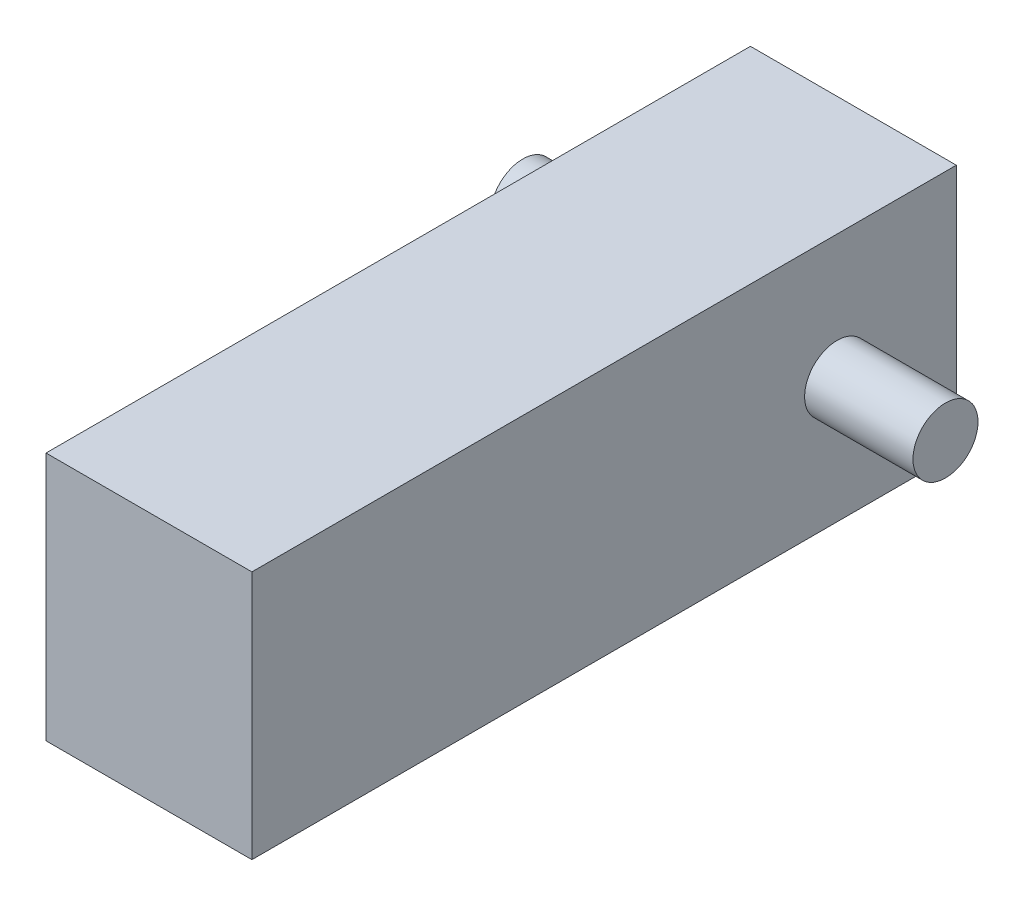
ISO-10303-21;
HEADER;
FILE_DESCRIPTION(('STEP AP214'),'2;1');
FILE_NAME('part.step','',(''),(''),'','','');
FILE_SCHEMA(('AUTOMOTIVE_DESIGN { 1 0 10303 214 1 1 1 1 }'));
ENDSEC;
DATA;
#1=APPLICATION_CONTEXT('core data for automotive mechanical design processes');
#2=APPLICATION_PROTOCOL_DEFINITION('international standard','automotive_design',2000,#1);
#3=PRODUCT_CONTEXT('',#1,'mechanical');
#4=PRODUCT('Part','Part','',(#3));
#5=PRODUCT_RELATED_PRODUCT_CATEGORY('part','',(#4));
#6=PRODUCT_DEFINITION_FORMATION('','',#4);
#7=PRODUCT_DEFINITION_CONTEXT('part definition',#1,'design');
#8=PRODUCT_DEFINITION('design','',#6,#7);
#9=PRODUCT_DEFINITION_SHAPE('','',#8);
#10=(LENGTH_UNIT() NAMED_UNIT(*) SI_UNIT(.MILLI.,.METRE.));
#11=(NAMED_UNIT(*) PLANE_ANGLE_UNIT() SI_UNIT($,.RADIAN.));
#12=(NAMED_UNIT(*) SI_UNIT($,.STERADIAN.) SOLID_ANGLE_UNIT());
#13=UNCERTAINTY_MEASURE_WITH_UNIT(LENGTH_MEASURE(1.E-05),#10,'distance_accuracy_value','');
#14=(GEOMETRIC_REPRESENTATION_CONTEXT(3) GLOBAL_UNCERTAINTY_ASSIGNED_CONTEXT((#13)) GLOBAL_UNIT_ASSIGNED_CONTEXT((#10,
#11,#12)) REPRESENTATION_CONTEXT('',''));
#15=CARTESIAN_POINT('',(0.,0.,0.));
#16=DIRECTION('',(0.,0.,1.));
#17=DIRECTION('',(1.,0.,0.));
#18=AXIS2_PLACEMENT_3D('',#15,#16,#17);
#19=CARTESIAN_POINT('',(-9.50000000000001,23.,-32.5));
#20=DIRECTION('',(1.,0.,0.));
#21=DIRECTION('',(0.,0.,-1.));
#22=AXIS2_PLACEMENT_3D('',#19,#20,#21);
#23=PLANE('',#22);
#24=DIRECTION('',(0.,0.,1.));
#25=VECTOR('',#24,1.);
#26=CARTESIAN_POINT('',(-9.50000000000001,0.,-32.5));
#27=LINE('',#26,#25);
#28=CARTESIAN_POINT('',(-9.50000000000001,0.,-32.5));
#29=VERTEX_POINT('',#28);
#30=CARTESIAN_POINT('',(-9.5,0.,32.5));
#31=VERTEX_POINT('',#30);
#32=EDGE_CURVE('E69',#29,#31,#27,.T.);
#33=ORIENTED_EDGE('',*,*,#32,.T.);
#34=DIRECTION('',(0.,-1.,0.));
#35=VECTOR('',#34,1.);
#36=CARTESIAN_POINT('',(-9.5,23.,32.5));
#37=LINE('',#36,#35);
#38=CARTESIAN_POINT('',(-9.5,23.,32.5));
#39=VERTEX_POINT('',#38);
#40=EDGE_CURVE('E95',#39,#31,#37,.T.);
#41=ORIENTED_EDGE('',*,*,#40,.F.);
#42=DIRECTION('',(0.,0.,1.));
#43=VECTOR('',#42,1.);
#44=CARTESIAN_POINT('',(-9.50000000000001,23.,-32.5));
#45=LINE('',#44,#43);
#46=CARTESIAN_POINT('',(-9.50000000000001,23.,-32.5));
#47=VERTEX_POINT('',#46);
#48=EDGE_CURVE('E86',#47,#39,#45,.T.);
#49=ORIENTED_EDGE('',*,*,#48,.F.);
#50=DIRECTION('',(0.,-1.,0.));
#51=VECTOR('',#50,1.);
#52=CARTESIAN_POINT('',(-9.50000000000001,23.,-32.5));
#53=LINE('',#52,#51);
#54=EDGE_CURVE('E91',#47,#29,#53,.T.);
#55=ORIENTED_EDGE('',*,*,#54,.T.);
#56=EDGE_LOOP('',(#33,#41,#49,#55));
#57=FACE_BOUND('',#56,.T.);
#58=CARTESIAN_POINT('',(-9.5,11.5,-21.5));
#59=DIRECTION('',(1.,0.,0.));
#60=DIRECTION('',(0.,0.,-1.));
#61=AXIS2_PLACEMENT_3D('',#58,#59,#60);
#62=CIRCLE('',#61,3.);
#63=CARTESIAN_POINT('',(-9.5,11.5,-24.5));
#64=VERTEX_POINT('',#63);
#65=EDGE_CURVE('E229',#64,#64,#62,.T.);
#66=ORIENTED_EDGE('',*,*,#65,.T.);
#67=EDGE_LOOP('',(#66));
#68=FACE_BOUND('',#67,.T.);
#69=CARTESIAN_POINT('',(-9.5,11.9628313913758,-9.50000000000001));
#70=DIRECTION('',(1.,0.,0.));
#71=DIRECTION('',(0.,0.,-1.));
#72=AXIS2_PLACEMENT_3D('',#69,#70,#71);
#73=CIRCLE('',#72,1.5);
#74=CARTESIAN_POINT('',(-9.5,11.9628313913758,-11.));
#75=VERTEX_POINT('',#74);
#76=EDGE_CURVE('E11',#75,#75,#73,.F.);
#77=ORIENTED_EDGE('',*,*,#76,.F.);
#78=EDGE_LOOP('',(#77));
#79=FACE_BOUND('',#78,.T.);
#80=ADVANCED_FACE('F35',(#57,#68,#79),#23,.F.);
#81=CARTESIAN_POINT('',(9.49999999999999,23.,-32.5));
#82=DIRECTION('',(-1.,0.,0.));
#83=DIRECTION('',(0.,0.,1.));
#84=AXIS2_PLACEMENT_3D('',#81,#82,#83);
#85=PLANE('',#84);
#86=DIRECTION('',(0.,0.,-1.));
#87=VECTOR('',#86,1.);
#88=CARTESIAN_POINT('',(9.49999999999999,0.,-32.5));
#89=LINE('',#88,#87);
#90=CARTESIAN_POINT('',(9.5,0.,32.5));
#91=VERTEX_POINT('',#90);
#92=CARTESIAN_POINT('',(9.49999999999999,0.,-32.5));
#93=VERTEX_POINT('',#92);
#94=EDGE_CURVE('E103',#91,#93,#89,.T.);
#95=ORIENTED_EDGE('',*,*,#94,.T.);
#96=DIRECTION('',(0.,-1.,0.));
#97=VECTOR('',#96,1.);
#98=CARTESIAN_POINT('',(9.49999999999999,23.,-32.5));
#99=LINE('',#98,#97);
#100=CARTESIAN_POINT('',(9.49999999999999,23.,-32.5));
#101=VERTEX_POINT('',#100);
#102=EDGE_CURVE('E94',#101,#93,#99,.T.);
#103=ORIENTED_EDGE('',*,*,#102,.F.);
#104=DIRECTION('',(0.,0.,-1.));
#105=VECTOR('',#104,1.);
#106=CARTESIAN_POINT('',(9.49999999999999,23.,-32.5));
#107=LINE('',#106,#105);
#108=CARTESIAN_POINT('',(9.5,23.,32.5));
#109=VERTEX_POINT('',#108);
#110=EDGE_CURVE('E88',#109,#101,#107,.T.);
#111=ORIENTED_EDGE('',*,*,#110,.F.);
#112=DIRECTION('',(0.,-1.,0.));
#113=VECTOR('',#112,1.);
#114=CARTESIAN_POINT('',(9.5,23.,32.5));
#115=LINE('',#114,#113);
#116=EDGE_CURVE('E99',#109,#91,#115,.T.);
#117=ORIENTED_EDGE('',*,*,#116,.T.);
#118=EDGE_LOOP('',(#95,#103,#111,#117));
#119=FACE_BOUND('',#118,.T.);
#120=CARTESIAN_POINT('',(9.5,11.5,-21.5));
#121=DIRECTION('',(-1.,0.,0.));
#122=DIRECTION('',(0.,0.,1.));
#123=AXIS2_PLACEMENT_3D('',#120,#121,#122);
#124=CIRCLE('',#123,3.);
#125=CARTESIAN_POINT('',(9.5,11.5,-18.5));
#126=VERTEX_POINT('',#125);
#127=EDGE_CURVE('E44',#126,#126,#124,.F.);
#128=ORIENTED_EDGE('',*,*,#127,.F.);
#129=EDGE_LOOP('',(#128));
#130=FACE_BOUND('',#129,.T.);
#131=ADVANCED_FACE('F37',(#119,#130),#85,.F.);
#132=CARTESIAN_POINT('',(-9.50000000000001,23.,-32.5));
#133=DIRECTION('',(0.,0.,1.));
#134=DIRECTION('',(1.,0.,0.));
#135=AXIS2_PLACEMENT_3D('',#132,#133,#134);
#136=PLANE('',#135);
#137=DIRECTION('',(-1.,0.,0.));
#138=VECTOR('',#137,1.);
#139=CARTESIAN_POINT('',(-9.50000000000001,0.,-32.5));
#140=LINE('',#139,#138);
#141=EDGE_CURVE('E93',#93,#29,#140,.T.);
#142=ORIENTED_EDGE('',*,*,#141,.T.);
#143=ORIENTED_EDGE('',*,*,#54,.F.);
#144=DIRECTION('',(-1.,0.,0.));
#145=VECTOR('',#144,1.);
#146=CARTESIAN_POINT('',(-9.50000000000001,23.,-32.5));
#147=LINE('',#146,#145);
#148=EDGE_CURVE('E83',#101,#47,#147,.T.);
#149=ORIENTED_EDGE('',*,*,#148,.F.);
#150=ORIENTED_EDGE('',*,*,#102,.T.);
#151=EDGE_LOOP('',(#142,#143,#149,#150));
#152=FACE_BOUND('',#151,.T.);
#153=ADVANCED_FACE('F92',(#152),#136,.F.);
#154=CARTESIAN_POINT('',(-9.5,23.,32.5));
#155=DIRECTION('',(0.,0.,-1.));
#156=DIRECTION('',(-1.,0.,0.));
#157=AXIS2_PLACEMENT_3D('',#154,#155,#156);
#158=PLANE('',#157);
#159=DIRECTION('',(1.,0.,0.));
#160=VECTOR('',#159,1.);
#161=CARTESIAN_POINT('',(-9.5,0.,32.5));
#162=LINE('',#161,#160);
#163=EDGE_CURVE('E75',#31,#91,#162,.T.);
#164=ORIENTED_EDGE('',*,*,#163,.T.);
#165=ORIENTED_EDGE('',*,*,#116,.F.);
#166=DIRECTION('',(1.,0.,0.));
#167=VECTOR('',#166,1.);
#168=CARTESIAN_POINT('',(-9.5,23.,32.5));
#169=LINE('',#168,#167);
#170=EDGE_CURVE('E52',#39,#109,#169,.T.);
#171=ORIENTED_EDGE('',*,*,#170,.F.);
#172=ORIENTED_EDGE('',*,*,#40,.T.);
#173=EDGE_LOOP('',(#164,#165,#171,#172));
#174=FACE_BOUND('',#173,.T.);
#175=ADVANCED_FACE('F123',(#174),#158,.F.);
#176=CARTESIAN_POINT('',(0.,23.,0.));
#177=DIRECTION('',(0.,1.,0.));
#178=DIRECTION('',(0.,0.,1.));
#179=AXIS2_PLACEMENT_3D('',#176,#177,#178);
#180=PLANE('',#179);
#181=ORIENTED_EDGE('',*,*,#110,.T.);
#182=ORIENTED_EDGE('',*,*,#148,.T.);
#183=ORIENTED_EDGE('',*,*,#48,.T.);
#184=ORIENTED_EDGE('',*,*,#170,.T.);
#185=EDGE_LOOP('',(#181,#182,#183,#184));
#186=FACE_BOUND('',#185,.T.);
#187=ADVANCED_FACE('F84',(#186),#180,.T.);
#188=CARTESIAN_POINT('',(0.,0.,0.));
#189=DIRECTION('',(0.,1.,0.));
#190=DIRECTION('',(0.,0.,1.));
#191=AXIS2_PLACEMENT_3D('',#188,#189,#190);
#192=PLANE('',#191);
#193=ORIENTED_EDGE('',*,*,#94,.F.);
#194=ORIENTED_EDGE('',*,*,#163,.F.);
#195=ORIENTED_EDGE('',*,*,#32,.F.);
#196=ORIENTED_EDGE('',*,*,#141,.F.);
#197=EDGE_LOOP('',(#193,#194,#195,#196));
#198=FACE_BOUND('',#197,.T.);
#199=ADVANCED_FACE('F127',(#198),#192,.F.);
#200=CARTESIAN_POINT('',(19.5,11.5,-21.5));
#201=DIRECTION('',(-1.,0.,0.));
#202=DIRECTION('',(0.,0.,1.));
#203=AXIS2_PLACEMENT_3D('',#200,#201,#202);
#204=CYLINDRICAL_SURFACE('',#203,3.);
#205=CARTESIAN_POINT('',(19.5,11.5,-21.5));
#206=DIRECTION('',(1.,0.,0.));
#207=DIRECTION('',(0.,0.,-1.));
#208=AXIS2_PLACEMENT_3D('',#205,#206,#207);
#209=CIRCLE('',#208,3.);
#210=CARTESIAN_POINT('',(19.5,11.5,-24.5));
#211=VERTEX_POINT('',#210);
#212=EDGE_CURVE('E106',#211,#211,#209,.T.);
#213=ORIENTED_EDGE('',*,*,#212,.F.);
#214=EDGE_LOOP('',(#213));
#215=FACE_BOUND('',#214,.T.);
#216=ORIENTED_EDGE('',*,*,#127,.T.);
#217=EDGE_LOOP('',(#216));
#218=FACE_BOUND('',#217,.T.);
#219=ADVANCED_FACE('F115',(#215,#218),#204,.T.);
#220=CARTESIAN_POINT('',(19.5,11.5,-21.5));
#221=DIRECTION('',(1.,0.,0.));
#222=DIRECTION('',(0.,0.,-1.));
#223=AXIS2_PLACEMENT_3D('',#220,#221,#222);
#224=PLANE('',#223);
#225=ORIENTED_EDGE('',*,*,#212,.T.);
#226=EDGE_LOOP('',(#225));
#227=FACE_BOUND('',#226,.T.);
#228=ADVANCED_FACE('F134',(#227),#224,.T.);
#229=CARTESIAN_POINT('',(-19.5,11.5,-21.5));
#230=DIRECTION('',(1.,0.,0.));
#231=DIRECTION('',(0.,0.,-1.));
#232=AXIS2_PLACEMENT_3D('',#229,#230,#231);
#233=CYLINDRICAL_SURFACE('',#232,3.);
#234=CARTESIAN_POINT('',(-19.5,11.5,-21.5));
#235=DIRECTION('',(1.,0.,0.));
#236=DIRECTION('',(0.,0.,-1.));
#237=AXIS2_PLACEMENT_3D('',#234,#235,#236);
#238=CIRCLE('',#237,3.);
#239=CARTESIAN_POINT('',(-19.5,11.5,-24.5));
#240=VERTEX_POINT('',#239);
#241=EDGE_CURVE('E226',#240,#240,#238,.T.);
#242=ORIENTED_EDGE('',*,*,#241,.T.);
#243=EDGE_LOOP('',(#242));
#244=FACE_BOUND('',#243,.T.);
#245=ORIENTED_EDGE('',*,*,#65,.F.);
#246=EDGE_LOOP('',(#245));
#247=FACE_BOUND('',#246,.T.);
#248=ADVANCED_FACE('F173',(#244,#247),#233,.T.);
#249=CARTESIAN_POINT('',(-19.5,11.5,-21.5));
#250=DIRECTION('',(1.,0.,0.));
#251=DIRECTION('',(0.,0.,-1.));
#252=AXIS2_PLACEMENT_3D('',#249,#250,#251);
#253=PLANE('',#252);
#254=ORIENTED_EDGE('',*,*,#241,.F.);
#255=EDGE_LOOP('',(#254));
#256=FACE_BOUND('',#255,.T.);
#257=ADVANCED_FACE('F183',(#256),#253,.F.);
#258=CARTESIAN_POINT('',(-10.5,11.9628313913758,-9.50000000000001));
#259=DIRECTION('',(1.,0.,0.));
#260=DIRECTION('',(0.,0.,-1.));
#261=AXIS2_PLACEMENT_3D('',#258,#259,#260);
#262=CYLINDRICAL_SURFACE('',#261,1.5);
#263=CARTESIAN_POINT('',(-10.5,11.9628313913758,-9.50000000000001));
#264=DIRECTION('',(-1.,0.,0.));
#265=DIRECTION('',(0.,0.,1.));
#266=AXIS2_PLACEMENT_3D('',#263,#264,#265);
#267=CIRCLE('',#266,1.5);
#268=CARTESIAN_POINT('',(-10.5,11.9628313913758,-8.00000000000001));
#269=VERTEX_POINT('',#268);
#270=EDGE_CURVE('E225',#269,#269,#267,.T.);
#271=ORIENTED_EDGE('',*,*,#270,.F.);
#272=EDGE_LOOP('',(#271));
#273=FACE_BOUND('',#272,.T.);
#274=ORIENTED_EDGE('',*,*,#76,.T.);
#275=EDGE_LOOP('',(#274));
#276=FACE_BOUND('',#275,.T.);
#277=ADVANCED_FACE('F193',(#273,#276),#262,.T.);
#278=CARTESIAN_POINT('',(-10.5,11.9628313913758,-9.50000000000001));
#279=DIRECTION('',(-1.,0.,0.));
#280=DIRECTION('',(0.,0.,1.));
#281=AXIS2_PLACEMENT_3D('',#278,#279,#280);
#282=PLANE('',#281);
#283=ORIENTED_EDGE('',*,*,#270,.T.);
#284=EDGE_LOOP('',(#283));
#285=FACE_BOUND('',#284,.T.);
#286=ADVANCED_FACE('F209',(#285),#282,.T.);
#287=CLOSED_SHELL('',(#80,#131,#153,#175,#187,#199,#219,#228,#248,#257,#277,#286));
#288=MANIFOLD_SOLID_BREP('B2',#287);
#289=ADVANCED_BREP_SHAPE_REPRESENTATION('',(#18,#288),#14);
#290=SHAPE_DEFINITION_REPRESENTATION(#9,#289);
ENDSEC;
END-ISO-10303-21;
